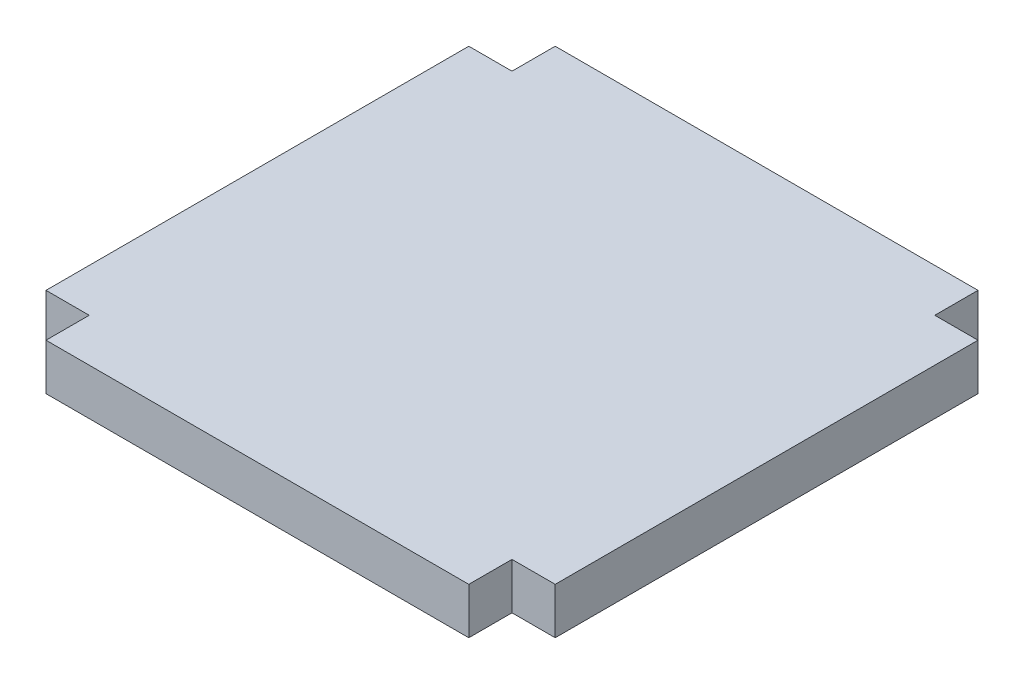
ISO-10303-21;
HEADER;
FILE_DESCRIPTION(('STEP AP214'),'2;1');
FILE_NAME('part.step','',(''),(''),'','','');
FILE_SCHEMA(('AUTOMOTIVE_DESIGN { 1 0 10303 214 1 1 1 1 }'));
ENDSEC;
DATA;
#1=APPLICATION_CONTEXT('core data for automotive mechanical design processes');
#2=APPLICATION_PROTOCOL_DEFINITION('international standard','automotive_design',2000,#1);
#3=PRODUCT_CONTEXT('',#1,'mechanical');
#4=PRODUCT('Part','Part','',(#3));
#5=PRODUCT_RELATED_PRODUCT_CATEGORY('part','',(#4));
#6=PRODUCT_DEFINITION_FORMATION('','',#4);
#7=PRODUCT_DEFINITION_CONTEXT('part definition',#1,'design');
#8=PRODUCT_DEFINITION('design','',#6,#7);
#9=PRODUCT_DEFINITION_SHAPE('','',#8);
#10=(LENGTH_UNIT() NAMED_UNIT(*) SI_UNIT(.MILLI.,.METRE.));
#11=(NAMED_UNIT(*) PLANE_ANGLE_UNIT() SI_UNIT($,.RADIAN.));
#12=(NAMED_UNIT(*) SI_UNIT($,.STERADIAN.) SOLID_ANGLE_UNIT());
#13=UNCERTAINTY_MEASURE_WITH_UNIT(LENGTH_MEASURE(1.E-05),#10,'distance_accuracy_value','');
#14=(GEOMETRIC_REPRESENTATION_CONTEXT(3) GLOBAL_UNCERTAINTY_ASSIGNED_CONTEXT((#13)) GLOBAL_UNIT_ASSIGNED_CONTEXT((#10,
#11,#12)) REPRESENTATION_CONTEXT('',''));
#15=CARTESIAN_POINT('',(0.,0.,0.));
#16=DIRECTION('',(0.,0.,1.));
#17=DIRECTION('',(1.,0.,0.));
#18=AXIS2_PLACEMENT_3D('',#15,#16,#17);
#19=CARTESIAN_POINT('',(0.,19.05,-86.995));
#20=DIRECTION('',(0.,0.,-1.));
#21=DIRECTION('',(-1.,0.,0.));
#22=AXIS2_PLACEMENT_3D('',#19,#20,#21);
#23=PLANE('',#22);
#24=DIRECTION('',(1.,0.,0.));
#25=VECTOR('',#24,1.);
#26=CARTESIAN_POINT('',(0.,0.,-86.995));
#27=LINE('',#26,#25);
#28=CARTESIAN_POINT('',(86.995,0.,-86.995));
#29=VERTEX_POINT('',#28);
#30=CARTESIAN_POINT('',(104.775,0.,-86.995));
#31=VERTEX_POINT('',#30);
#32=EDGE_CURVE('E162',#29,#31,#27,.T.);
#33=ORIENTED_EDGE('',*,*,#32,.F.);
#34=DIRECTION('',(0.,-1.,0.));
#35=VECTOR('',#34,1.);
#36=CARTESIAN_POINT('',(86.995,19.05,-86.995));
#37=LINE('',#36,#35);
#38=CARTESIAN_POINT('',(86.995,19.05,-86.995));
#39=VERTEX_POINT('',#38);
#40=EDGE_CURVE('E11',#39,#29,#37,.T.);
#41=ORIENTED_EDGE('',*,*,#40,.F.);
#42=DIRECTION('',(1.,0.,0.));
#43=VECTOR('',#42,1.);
#44=CARTESIAN_POINT('',(0.,19.05,-86.995));
#45=LINE('',#44,#43);
#46=CARTESIAN_POINT('',(104.775,19.05,-86.995));
#47=VERTEX_POINT('',#46);
#48=EDGE_CURVE('E203',#39,#47,#45,.T.);
#49=ORIENTED_EDGE('',*,*,#48,.T.);
#50=DIRECTION('',(0.,-1.,0.));
#51=VECTOR('',#50,1.);
#52=CARTESIAN_POINT('',(104.775,19.05,-86.995));
#53=LINE('',#52,#51);
#54=EDGE_CURVE('E104',#47,#31,#53,.T.);
#55=ORIENTED_EDGE('',*,*,#54,.T.);
#56=EDGE_LOOP('',(#33,#41,#49,#55));
#57=FACE_BOUND('',#56,.T.);
#58=ADVANCED_FACE('F40',(#57),#23,.T.);
#59=CARTESIAN_POINT('',(86.995,19.05,0.));
#60=DIRECTION('',(1.,0.,0.));
#61=DIRECTION('',(0.,0.,-1.));
#62=AXIS2_PLACEMENT_3D('',#59,#60,#61);
#63=PLANE('',#62);
#64=DIRECTION('',(0.,0.,1.));
#65=VECTOR('',#64,1.);
#66=CARTESIAN_POINT('',(86.995,0.,0.));
#67=LINE('',#66,#65);
#68=CARTESIAN_POINT('',(86.995,0.,-104.775));
#69=VERTEX_POINT('',#68);
#70=EDGE_CURVE('E166',#69,#29,#67,.T.);
#71=ORIENTED_EDGE('',*,*,#70,.F.);
#72=DIRECTION('',(0.,-1.,0.));
#73=VECTOR('',#72,1.);
#74=CARTESIAN_POINT('',(86.995,19.05,-104.775));
#75=LINE('',#74,#73);
#76=CARTESIAN_POINT('',(86.995,19.05,-104.775));
#77=VERTEX_POINT('',#76);
#78=EDGE_CURVE('E49',#77,#69,#75,.T.);
#79=ORIENTED_EDGE('',*,*,#78,.F.);
#80=DIRECTION('',(0.,0.,1.));
#81=VECTOR('',#80,1.);
#82=CARTESIAN_POINT('',(86.995,19.05,0.));
#83=LINE('',#82,#81);
#84=EDGE_CURVE('E300',#77,#39,#83,.T.);
#85=ORIENTED_EDGE('',*,*,#84,.T.);
#86=ORIENTED_EDGE('',*,*,#40,.T.);
#87=EDGE_LOOP('',(#71,#79,#85,#86));
#88=FACE_BOUND('',#87,.T.);
#89=ADVANCED_FACE('F239',(#88),#63,.T.);
#90=CARTESIAN_POINT('',(0.,19.05,-104.775));
#91=DIRECTION('',(0.,0.,-1.));
#92=DIRECTION('',(-1.,0.,0.));
#93=AXIS2_PLACEMENT_3D('',#90,#91,#92);
#94=PLANE('',#93);
#95=DIRECTION('',(1.,0.,0.));
#96=VECTOR('',#95,1.);
#97=CARTESIAN_POINT('',(0.,0.,-104.775));
#98=LINE('',#97,#96);
#99=CARTESIAN_POINT('',(-86.995,0.,-104.775));
#100=VERTEX_POINT('',#99);
#101=EDGE_CURVE('E170',#100,#69,#98,.T.);
#102=ORIENTED_EDGE('',*,*,#101,.F.);
#103=DIRECTION('',(0.,-1.,0.));
#104=VECTOR('',#103,1.);
#105=CARTESIAN_POINT('',(-86.995,19.05,-104.775));
#106=LINE('',#105,#104);
#107=CARTESIAN_POINT('',(-86.995,19.05,-104.775));
#108=VERTEX_POINT('',#107);
#109=EDGE_CURVE('E226',#108,#100,#106,.T.);
#110=ORIENTED_EDGE('',*,*,#109,.F.);
#111=DIRECTION('',(1.,0.,0.));
#112=VECTOR('',#111,1.);
#113=CARTESIAN_POINT('',(0.,19.05,-104.775));
#114=LINE('',#113,#112);
#115=EDGE_CURVE('E235',#108,#77,#114,.T.);
#116=ORIENTED_EDGE('',*,*,#115,.T.);
#117=ORIENTED_EDGE('',*,*,#78,.T.);
#118=EDGE_LOOP('',(#102,#110,#116,#117));
#119=FACE_BOUND('',#118,.T.);
#120=ADVANCED_FACE('F233',(#119),#94,.T.);
#121=CARTESIAN_POINT('',(-86.995,19.05,0.));
#122=DIRECTION('',(1.,0.,0.));
#123=DIRECTION('',(0.,0.,-1.));
#124=AXIS2_PLACEMENT_3D('',#121,#122,#123);
#125=PLANE('',#124);
#126=DIRECTION('',(0.,0.,1.));
#127=VECTOR('',#126,1.);
#128=CARTESIAN_POINT('',(-86.995,0.,0.));
#129=LINE('',#128,#127);
#130=CARTESIAN_POINT('',(-86.995,0.,-86.995));
#131=VERTEX_POINT('',#130);
#132=EDGE_CURVE('E174',#100,#131,#129,.T.);
#133=ORIENTED_EDGE('',*,*,#132,.T.);
#134=DIRECTION('',(0.,-1.,0.));
#135=VECTOR('',#134,1.);
#136=CARTESIAN_POINT('',(-86.995,19.05,-86.995));
#137=LINE('',#136,#135);
#138=CARTESIAN_POINT('',(-86.995,19.05,-86.995));
#139=VERTEX_POINT('',#138);
#140=EDGE_CURVE('E222',#139,#131,#137,.T.);
#141=ORIENTED_EDGE('',*,*,#140,.F.);
#142=DIRECTION('',(0.,0.,1.));
#143=VECTOR('',#142,1.);
#144=CARTESIAN_POINT('',(-86.995,19.05,0.));
#145=LINE('',#144,#143);
#146=EDGE_CURVE('E257',#108,#139,#145,.T.);
#147=ORIENTED_EDGE('',*,*,#146,.F.);
#148=ORIENTED_EDGE('',*,*,#109,.T.);
#149=EDGE_LOOP('',(#133,#141,#147,#148));
#150=FACE_BOUND('',#149,.T.);
#151=ADVANCED_FACE('F246',(#150),#125,.F.);
#152=CARTESIAN_POINT('',(0.,19.05,-86.995));
#153=DIRECTION('',(0.,0.,1.));
#154=DIRECTION('',(1.,0.,0.));
#155=AXIS2_PLACEMENT_3D('',#152,#153,#154);
#156=PLANE('',#155);
#157=DIRECTION('',(-1.,0.,0.));
#158=VECTOR('',#157,1.);
#159=CARTESIAN_POINT('',(0.,0.,-86.995));
#160=LINE('',#159,#158);
#161=CARTESIAN_POINT('',(-104.775,0.,-86.995));
#162=VERTEX_POINT('',#161);
#163=EDGE_CURVE('E177',#131,#162,#160,.T.);
#164=ORIENTED_EDGE('',*,*,#163,.T.);
#165=DIRECTION('',(0.,-1.,0.));
#166=VECTOR('',#165,1.);
#167=CARTESIAN_POINT('',(-104.775,19.05,-86.995));
#168=LINE('',#167,#166);
#169=CARTESIAN_POINT('',(-104.775,19.05,-86.995));
#170=VERTEX_POINT('',#169);
#171=EDGE_CURVE('E219',#170,#162,#168,.T.);
#172=ORIENTED_EDGE('',*,*,#171,.F.);
#173=DIRECTION('',(-1.,0.,0.));
#174=VECTOR('',#173,1.);
#175=CARTESIAN_POINT('',(0.,19.05,-86.995));
#176=LINE('',#175,#174);
#177=EDGE_CURVE('E252',#139,#170,#176,.T.);
#178=ORIENTED_EDGE('',*,*,#177,.F.);
#179=ORIENTED_EDGE('',*,*,#140,.T.);
#180=EDGE_LOOP('',(#164,#172,#178,#179));
#181=FACE_BOUND('',#180,.T.);
#182=ADVANCED_FACE('F250',(#181),#156,.F.);
#183=CARTESIAN_POINT('',(-104.775,19.05,0.));
#184=DIRECTION('',(-1.,0.,0.));
#185=DIRECTION('',(0.,0.,1.));
#186=AXIS2_PLACEMENT_3D('',#183,#184,#185);
#187=PLANE('',#186);
#188=DIRECTION('',(0.,0.,-1.));
#189=VECTOR('',#188,1.);
#190=CARTESIAN_POINT('',(-104.775,0.,0.));
#191=LINE('',#190,#189);
#192=CARTESIAN_POINT('',(-104.775,0.,86.995));
#193=VERTEX_POINT('',#192);
#194=EDGE_CURVE('E181',#193,#162,#191,.T.);
#195=ORIENTED_EDGE('',*,*,#194,.F.);
#196=DIRECTION('',(0.,-1.,0.));
#197=VECTOR('',#196,1.);
#198=CARTESIAN_POINT('',(-104.775,19.05,86.995));
#199=LINE('',#198,#197);
#200=CARTESIAN_POINT('',(-104.775,19.05,86.995));
#201=VERTEX_POINT('',#200);
#202=EDGE_CURVE('E216',#201,#193,#199,.T.);
#203=ORIENTED_EDGE('',*,*,#202,.F.);
#204=DIRECTION('',(0.,0.,-1.));
#205=VECTOR('',#204,1.);
#206=CARTESIAN_POINT('',(-104.775,19.05,0.));
#207=LINE('',#206,#205);
#208=EDGE_CURVE('E256',#201,#170,#207,.T.);
#209=ORIENTED_EDGE('',*,*,#208,.T.);
#210=ORIENTED_EDGE('',*,*,#171,.T.);
#211=EDGE_LOOP('',(#195,#203,#209,#210));
#212=FACE_BOUND('',#211,.T.);
#213=ADVANCED_FACE('F356',(#212),#187,.T.);
#214=CARTESIAN_POINT('',(0.,19.05,86.995));
#215=DIRECTION('',(0.,0.,1.));
#216=DIRECTION('',(1.,0.,0.));
#217=AXIS2_PLACEMENT_3D('',#214,#215,#216);
#218=PLANE('',#217);
#219=DIRECTION('',(-1.,0.,0.));
#220=VECTOR('',#219,1.);
#221=CARTESIAN_POINT('',(0.,0.,86.995));
#222=LINE('',#221,#220);
#223=CARTESIAN_POINT('',(-86.995,0.,86.995));
#224=VERTEX_POINT('',#223);
#225=EDGE_CURVE('E185',#224,#193,#222,.T.);
#226=ORIENTED_EDGE('',*,*,#225,.F.);
#227=DIRECTION('',(0.,-1.,0.));
#228=VECTOR('',#227,1.);
#229=CARTESIAN_POINT('',(-86.995,19.05,86.995));
#230=LINE('',#229,#228);
#231=CARTESIAN_POINT('',(-86.995,19.05,86.995));
#232=VERTEX_POINT('',#231);
#233=EDGE_CURVE('E213',#232,#224,#230,.T.);
#234=ORIENTED_EDGE('',*,*,#233,.F.);
#235=DIRECTION('',(-1.,0.,0.));
#236=VECTOR('',#235,1.);
#237=CARTESIAN_POINT('',(0.,19.05,86.995));
#238=LINE('',#237,#236);
#239=EDGE_CURVE('E261',#232,#201,#238,.T.);
#240=ORIENTED_EDGE('',*,*,#239,.T.);
#241=ORIENTED_EDGE('',*,*,#202,.T.);
#242=EDGE_LOOP('',(#226,#234,#240,#241));
#243=FACE_BOUND('',#242,.T.);
#244=ADVANCED_FACE('F279',(#243),#218,.T.);
#245=CARTESIAN_POINT('',(-86.995,19.05,0.));
#246=DIRECTION('',(-1.,0.,0.));
#247=DIRECTION('',(0.,0.,1.));
#248=AXIS2_PLACEMENT_3D('',#245,#246,#247);
#249=PLANE('',#248);
#250=DIRECTION('',(0.,0.,-1.));
#251=VECTOR('',#250,1.);
#252=CARTESIAN_POINT('',(-86.995,0.,0.));
#253=LINE('',#252,#251);
#254=CARTESIAN_POINT('',(-86.995,0.,104.775));
#255=VERTEX_POINT('',#254);
#256=EDGE_CURVE('E189',#255,#224,#253,.T.);
#257=ORIENTED_EDGE('',*,*,#256,.F.);
#258=DIRECTION('',(0.,-1.,0.));
#259=VECTOR('',#258,1.);
#260=CARTESIAN_POINT('',(-86.995,19.05,104.775));
#261=LINE('',#260,#259);
#262=CARTESIAN_POINT('',(-86.995,19.05,104.775));
#263=VERTEX_POINT('',#262);
#264=EDGE_CURVE('E210',#263,#255,#261,.T.);
#265=ORIENTED_EDGE('',*,*,#264,.F.);
#266=DIRECTION('',(0.,0.,-1.));
#267=VECTOR('',#266,1.);
#268=CARTESIAN_POINT('',(-86.995,19.05,0.));
#269=LINE('',#268,#267);
#270=EDGE_CURVE('E269',#263,#232,#269,.T.);
#271=ORIENTED_EDGE('',*,*,#270,.T.);
#272=ORIENTED_EDGE('',*,*,#233,.T.);
#273=EDGE_LOOP('',(#257,#265,#271,#272));
#274=FACE_BOUND('',#273,.T.);
#275=ADVANCED_FACE('F275',(#274),#249,.T.);
#276=CARTESIAN_POINT('',(0.,19.05,104.775));
#277=DIRECTION('',(0.,0.,-1.));
#278=DIRECTION('',(-1.,0.,0.));
#279=AXIS2_PLACEMENT_3D('',#276,#277,#278);
#280=PLANE('',#279);
#281=DIRECTION('',(1.,0.,0.));
#282=VECTOR('',#281,1.);
#283=CARTESIAN_POINT('',(0.,0.,104.775));
#284=LINE('',#283,#282);
#285=CARTESIAN_POINT('',(86.995,0.,104.775));
#286=VERTEX_POINT('',#285);
#287=EDGE_CURVE('E193',#255,#286,#284,.T.);
#288=ORIENTED_EDGE('',*,*,#287,.T.);
#289=DIRECTION('',(0.,-1.,0.));
#290=VECTOR('',#289,1.);
#291=CARTESIAN_POINT('',(86.995,19.05,104.775));
#292=LINE('',#291,#290);
#293=CARTESIAN_POINT('',(86.995,19.05,104.775));
#294=VERTEX_POINT('',#293);
#295=EDGE_CURVE('E152',#294,#286,#292,.T.);
#296=ORIENTED_EDGE('',*,*,#295,.F.);
#297=DIRECTION('',(1.,0.,0.));
#298=VECTOR('',#297,1.);
#299=CARTESIAN_POINT('',(0.,19.05,104.775));
#300=LINE('',#299,#298);
#301=EDGE_CURVE('E141',#263,#294,#300,.T.);
#302=ORIENTED_EDGE('',*,*,#301,.F.);
#303=ORIENTED_EDGE('',*,*,#264,.T.);
#304=EDGE_LOOP('',(#288,#296,#302,#303));
#305=FACE_BOUND('',#304,.T.);
#306=ADVANCED_FACE('F283',(#305),#280,.F.);
#307=CARTESIAN_POINT('',(86.995,19.05,0.));
#308=DIRECTION('',(-1.,0.,0.));
#309=DIRECTION('',(0.,0.,1.));
#310=AXIS2_PLACEMENT_3D('',#307,#308,#309);
#311=PLANE('',#310);
#312=DIRECTION('',(0.,0.,-1.));
#313=VECTOR('',#312,1.);
#314=CARTESIAN_POINT('',(86.995,0.,0.));
#315=LINE('',#314,#313);
#316=CARTESIAN_POINT('',(86.995,0.,86.995));
#317=VERTEX_POINT('',#316);
#318=EDGE_CURVE('E150',#286,#317,#315,.T.);
#319=ORIENTED_EDGE('',*,*,#318,.T.);
#320=DIRECTION('',(0.,-1.,0.));
#321=VECTOR('',#320,1.);
#322=CARTESIAN_POINT('',(86.995,19.05,86.995));
#323=LINE('',#322,#321);
#324=CARTESIAN_POINT('',(86.995,19.05,86.995));
#325=VERTEX_POINT('',#324);
#326=EDGE_CURVE('E147',#325,#317,#323,.T.);
#327=ORIENTED_EDGE('',*,*,#326,.F.);
#328=DIRECTION('',(0.,0.,-1.));
#329=VECTOR('',#328,1.);
#330=CARTESIAN_POINT('',(86.995,19.05,0.));
#331=LINE('',#330,#329);
#332=EDGE_CURVE('E134',#294,#325,#331,.T.);
#333=ORIENTED_EDGE('',*,*,#332,.F.);
#334=ORIENTED_EDGE('',*,*,#295,.T.);
#335=EDGE_LOOP('',(#319,#327,#333,#334));
#336=FACE_BOUND('',#335,.T.);
#337=ADVANCED_FACE('F148',(#336),#311,.F.);
#338=CARTESIAN_POINT('',(0.,19.05,86.995));
#339=DIRECTION('',(0.,0.,-1.));
#340=DIRECTION('',(-1.,0.,0.));
#341=AXIS2_PLACEMENT_3D('',#338,#339,#340);
#342=PLANE('',#341);
#343=DIRECTION('',(1.,0.,0.));
#344=VECTOR('',#343,1.);
#345=CARTESIAN_POINT('',(0.,0.,86.995));
#346=LINE('',#345,#344);
#347=CARTESIAN_POINT('',(104.775,0.,86.995));
#348=VERTEX_POINT('',#347);
#349=EDGE_CURVE('E97',#317,#348,#346,.T.);
#350=ORIENTED_EDGE('',*,*,#349,.T.);
#351=DIRECTION('',(0.,-1.,0.));
#352=VECTOR('',#351,1.);
#353=CARTESIAN_POINT('',(104.775,19.05,86.995));
#354=LINE('',#353,#352);
#355=CARTESIAN_POINT('',(104.775,19.05,86.995));
#356=VERTEX_POINT('',#355);
#357=EDGE_CURVE('E153',#356,#348,#354,.T.);
#358=ORIENTED_EDGE('',*,*,#357,.F.);
#359=DIRECTION('',(1.,0.,0.));
#360=VECTOR('',#359,1.);
#361=CARTESIAN_POINT('',(0.,19.05,86.995));
#362=LINE('',#361,#360);
#363=EDGE_CURVE('E138',#325,#356,#362,.T.);
#364=ORIENTED_EDGE('',*,*,#363,.F.);
#365=ORIENTED_EDGE('',*,*,#326,.T.);
#366=EDGE_LOOP('',(#350,#358,#364,#365));
#367=FACE_BOUND('',#366,.T.);
#368=ADVANCED_FACE('F155',(#367),#342,.F.);
#369=CARTESIAN_POINT('',(104.775,19.05,0.));
#370=DIRECTION('',(-1.,0.,0.));
#371=DIRECTION('',(0.,0.,1.));
#372=AXIS2_PLACEMENT_3D('',#369,#370,#371);
#373=PLANE('',#372);
#374=DIRECTION('',(0.,0.,-1.));
#375=VECTOR('',#374,1.);
#376=CARTESIAN_POINT('',(104.775,0.,0.));
#377=LINE('',#376,#375);
#378=EDGE_CURVE('E200',#348,#31,#377,.T.);
#379=ORIENTED_EDGE('',*,*,#378,.T.);
#380=ORIENTED_EDGE('',*,*,#54,.F.);
#381=DIRECTION('',(0.,0.,-1.));
#382=VECTOR('',#381,1.);
#383=CARTESIAN_POINT('',(104.775,19.05,0.));
#384=LINE('',#383,#382);
#385=EDGE_CURVE('E57',#356,#47,#384,.T.);
#386=ORIENTED_EDGE('',*,*,#385,.F.);
#387=ORIENTED_EDGE('',*,*,#357,.T.);
#388=EDGE_LOOP('',(#379,#380,#386,#387));
#389=FACE_BOUND('',#388,.T.);
#390=ADVANCED_FACE('F298',(#389),#373,.F.);
#391=CARTESIAN_POINT('',(0.,19.05,0.));
#392=DIRECTION('',(0.,1.,0.));
#393=DIRECTION('',(0.,0.,1.));
#394=AXIS2_PLACEMENT_3D('',#391,#392,#393);
#395=PLANE('',#394);
#396=ORIENTED_EDGE('',*,*,#48,.F.);
#397=ORIENTED_EDGE('',*,*,#84,.F.);
#398=ORIENTED_EDGE('',*,*,#115,.F.);
#399=ORIENTED_EDGE('',*,*,#146,.T.);
#400=ORIENTED_EDGE('',*,*,#177,.T.);
#401=ORIENTED_EDGE('',*,*,#208,.F.);
#402=ORIENTED_EDGE('',*,*,#239,.F.);
#403=ORIENTED_EDGE('',*,*,#270,.F.);
#404=ORIENTED_EDGE('',*,*,#301,.T.);
#405=ORIENTED_EDGE('',*,*,#332,.T.);
#406=ORIENTED_EDGE('',*,*,#363,.T.);
#407=ORIENTED_EDGE('',*,*,#385,.T.);
#408=EDGE_LOOP('',(#396,#397,#398,#399,#400,#401,#402,#403,#404,#405,#406,#407));
#409=FACE_BOUND('',#408,.T.);
#410=ADVANCED_FACE('F136',(#409),#395,.T.);
#411=CARTESIAN_POINT('',(0.,0.,0.));
#412=DIRECTION('',(0.,1.,0.));
#413=DIRECTION('',(0.,0.,1.));
#414=AXIS2_PLACEMENT_3D('',#411,#412,#413);
#415=PLANE('',#414);
#416=ORIENTED_EDGE('',*,*,#32,.T.);
#417=ORIENTED_EDGE('',*,*,#378,.F.);
#418=ORIENTED_EDGE('',*,*,#349,.F.);
#419=ORIENTED_EDGE('',*,*,#318,.F.);
#420=ORIENTED_EDGE('',*,*,#287,.F.);
#421=ORIENTED_EDGE('',*,*,#256,.T.);
#422=ORIENTED_EDGE('',*,*,#225,.T.);
#423=ORIENTED_EDGE('',*,*,#194,.T.);
#424=ORIENTED_EDGE('',*,*,#163,.F.);
#425=ORIENTED_EDGE('',*,*,#132,.F.);
#426=ORIENTED_EDGE('',*,*,#101,.T.);
#427=ORIENTED_EDGE('',*,*,#70,.T.);
#428=EDGE_LOOP('',(#416,#417,#418,#419,#420,#421,#422,#423,#424,#425,#426,#427));
#429=FACE_BOUND('',#428,.T.);
#430=ADVANCED_FACE('F242',(#429),#415,.F.);
#431=CLOSED_SHELL('',(#58,#89,#120,#151,#182,#213,#244,#275,#306,#337,#368,#390,#410,#430));
#432=MANIFOLD_SOLID_BREP('B2',#431);
#433=ADVANCED_BREP_SHAPE_REPRESENTATION('',(#18,#432),#14);
#434=SHAPE_DEFINITION_REPRESENTATION(#9,#433);
ENDSEC;
END-ISO-10303-21;
